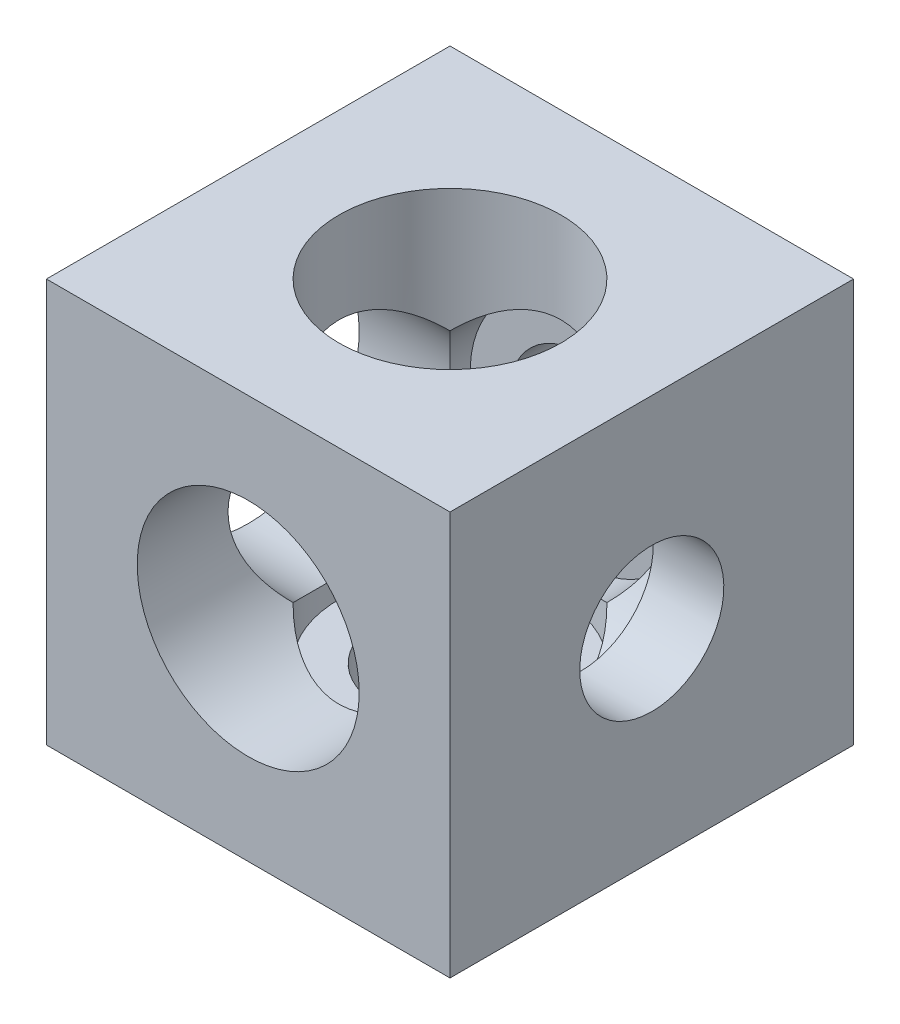
ISO-10303-21;
HEADER;
FILE_DESCRIPTION(('STEP AP214'),'2;1');
FILE_NAME('part.step','',(''),(''),'','','');
FILE_SCHEMA(('AUTOMOTIVE_DESIGN { 1 0 10303 214 1 1 1 1 }'));
ENDSEC;
DATA;
#1=APPLICATION_CONTEXT('core data for automotive mechanical design processes');
#2=APPLICATION_PROTOCOL_DEFINITION('international standard','automotive_design',2000,#1);
#3=PRODUCT_CONTEXT('',#1,'mechanical');
#4=PRODUCT('Part','Part','',(#3));
#5=PRODUCT_RELATED_PRODUCT_CATEGORY('part','',(#4));
#6=PRODUCT_DEFINITION_FORMATION('','',#4);
#7=PRODUCT_DEFINITION_CONTEXT('part definition',#1,'design');
#8=PRODUCT_DEFINITION('design','',#6,#7);
#9=PRODUCT_DEFINITION_SHAPE('','',#8);
#10=(LENGTH_UNIT() NAMED_UNIT(*) SI_UNIT(.MILLI.,.METRE.));
#11=(NAMED_UNIT(*) PLANE_ANGLE_UNIT() SI_UNIT($,.RADIAN.));
#12=(NAMED_UNIT(*) SI_UNIT($,.STERADIAN.) SOLID_ANGLE_UNIT());
#13=UNCERTAINTY_MEASURE_WITH_UNIT(LENGTH_MEASURE(1.E-05),#10,'distance_accuracy_value','');
#14=(GEOMETRIC_REPRESENTATION_CONTEXT(3) GLOBAL_UNCERTAINTY_ASSIGNED_CONTEXT((#13)) GLOBAL_UNIT_ASSIGNED_CONTEXT((#10,
#11,#12)) REPRESENTATION_CONTEXT('',''));
#15=CARTESIAN_POINT('',(0.,0.,0.));
#16=DIRECTION('',(0.,0.,1.));
#17=DIRECTION('',(1.,0.,0.));
#18=AXIS2_PLACEMENT_3D('',#15,#16,#17);
#19=CARTESIAN_POINT('',(0.,-10.,0.));
#20=DIRECTION('',(0.,1.,0.));
#21=DIRECTION('',(0.,0.,1.));
#22=AXIS2_PLACEMENT_3D('',#19,#20,#21);
#23=CYLINDRICAL_SURFACE('',#22,3.57);
#24=CARTESIAN_POINT('',(0.,-10.,0.));
#25=DIRECTION('',(0.,1.,0.));
#26=DIRECTION('',(0.,0.,1.));
#27=AXIS2_PLACEMENT_3D('',#24,#25,#26);
#28=CIRCLE('',#27,3.57);
#29=CARTESIAN_POINT('',(0.,-10.,3.57));
#30=VERTEX_POINT('',#29);
#31=EDGE_CURVE('E144',#30,#30,#28,.T.);
#32=ORIENTED_EDGE('',*,*,#31,.F.);
#33=EDGE_LOOP('',(#32));
#34=FACE_BOUND('',#33,.T.);
#35=CARTESIAN_POINT('',(0.,-6.5,0.));
#36=DIRECTION('',(0.,1.,0.));
#37=DIRECTION('',(0.,0.,1.));
#38=AXIS2_PLACEMENT_3D('',#35,#36,#37);
#39=CIRCLE('',#38,3.57);
#40=CARTESIAN_POINT('',(0.,-6.5,3.57));
#41=VERTEX_POINT('',#40);
#42=EDGE_CURVE('E112',#41,#41,#39,.F.);
#43=ORIENTED_EDGE('',*,*,#42,.F.);
#44=EDGE_LOOP('',(#43));
#45=FACE_BOUND('',#44,.T.);
#46=ADVANCED_FACE('F34',(#34,#45),#23,.F.);
#47=CARTESIAN_POINT('',(0.,0.,-25.556349186104));
#48=DIRECTION('',(0.,0.,1.));
#49=DIRECTION('',(1.,0.,0.));
#50=AXIS2_PLACEMENT_3D('',#47,#48,#49);
#51=CYLINDRICAL_SURFACE('',#50,5.5);
#52=CARTESIAN_POINT('',(0.,0.,10.));
#53=DIRECTION('',(0.,0.,1.));
#54=DIRECTION('',(1.,0.,0.));
#55=AXIS2_PLACEMENT_3D('',#52,#53,#54);
#56=CIRCLE('',#55,5.5);
#57=CARTESIAN_POINT('',(5.5,0.,10.));
#58=VERTEX_POINT('',#57);
#59=EDGE_CURVE('E157',#58,#58,#56,.T.);
#60=ORIENTED_EDGE('',*,*,#59,.T.);
#61=EDGE_LOOP('',(#60));
#62=FACE_BOUND('',#61,.T.);
#63=CARTESIAN_POINT('',(0.,0.,0.));
#64=DIRECTION('',(-0.707106781186547,0.,0.707106781186547));
#65=DIRECTION('',(0.707106781186547,0.,0.707106781186547));
#66=AXIS2_PLACEMENT_3D('',#63,#64,#65);
#67=ELLIPSE('',#66,7.77817459305202,5.5);
#68=CARTESIAN_POINT('',(3.88908729652601,3.88908729652601,3.88908729652601));
#69=VERTEX_POINT('',#68);
#70=CARTESIAN_POINT('',(3.88908729652601,-3.88908729652601,3.88908729652601));
#71=VERTEX_POINT('',#70);
#72=EDGE_CURVE('E103',#69,#71,#67,.F.);
#73=ORIENTED_EDGE('',*,*,#72,.T.);
#74=CARTESIAN_POINT('',(0.,0.,0.));
#75=DIRECTION('',(0.,0.707106781186547,0.707106781186547));
#76=DIRECTION('',(0.,-0.707106781186547,0.707106781186547));
#77=AXIS2_PLACEMENT_3D('',#74,#75,#76);
#78=ELLIPSE('',#77,7.77817459305202,5.5);
#79=CARTESIAN_POINT('',(-3.88908729652601,-3.88908729652601,3.88908729652601));
#80=VERTEX_POINT('',#79);
#81=EDGE_CURVE('E138',#71,#80,#78,.F.);
#82=ORIENTED_EDGE('',*,*,#81,.T.);
#83=CARTESIAN_POINT('',(0.,0.,0.));
#84=DIRECTION('',(0.707106781186547,0.,0.707106781186547));
#85=DIRECTION('',(-0.707106781186547,0.,0.707106781186547));
#86=AXIS2_PLACEMENT_3D('',#83,#84,#85);
#87=ELLIPSE('',#86,7.77817459305202,5.5);
#88=CARTESIAN_POINT('',(-3.88908729652601,3.88908729652601,3.88908729652601));
#89=VERTEX_POINT('',#88);
#90=EDGE_CURVE('E118',#80,#89,#87,.F.);
#91=ORIENTED_EDGE('',*,*,#90,.T.);
#92=CARTESIAN_POINT('',(0.,0.,0.));
#93=DIRECTION('',(0.,-0.707106781186547,0.707106781186547));
#94=DIRECTION('',(0.,0.707106781186547,0.707106781186547));
#95=AXIS2_PLACEMENT_3D('',#92,#93,#94);
#96=ELLIPSE('',#95,7.77817459305202,5.5);
#97=EDGE_CURVE('E56',#89,#69,#96,.F.);
#98=ORIENTED_EDGE('',*,*,#97,.T.);
#99=EDGE_LOOP('',(#73,#82,#91,#98));
#100=FACE_BOUND('',#99,.T.);
#101=ADVANCED_FACE('F201',(#62,#100),#51,.F.);
#102=CARTESIAN_POINT('',(10.,0.,0.));
#103=DIRECTION('',(-1.,0.,0.));
#104=DIRECTION('',(0.,-1.,0.));
#105=AXIS2_PLACEMENT_3D('',#102,#103,#104);
#106=CYLINDRICAL_SURFACE('',#105,3.57);
#107=CARTESIAN_POINT('',(10.,0.,0.));
#108=DIRECTION('',(-1.,0.,0.));
#109=DIRECTION('',(0.,-1.,0.));
#110=AXIS2_PLACEMENT_3D('',#107,#108,#109);
#111=CIRCLE('',#110,3.57);
#112=CARTESIAN_POINT('',(10.,-3.57,0.));
#113=VERTEX_POINT('',#112);
#114=EDGE_CURVE('E154',#113,#113,#111,.T.);
#115=ORIENTED_EDGE('',*,*,#114,.F.);
#116=EDGE_LOOP('',(#115));
#117=FACE_BOUND('',#116,.T.);
#118=CARTESIAN_POINT('',(6.5,0.,0.));
#119=DIRECTION('',(-1.,0.,0.));
#120=DIRECTION('',(0.,-1.,0.));
#121=AXIS2_PLACEMENT_3D('',#118,#119,#120);
#122=CIRCLE('',#121,3.57);
#123=CARTESIAN_POINT('',(6.5,-3.57,0.));
#124=VERTEX_POINT('',#123);
#125=EDGE_CURVE('E153',#124,#124,#122,.F.);
#126=ORIENTED_EDGE('',*,*,#125,.F.);
#127=EDGE_LOOP('',(#126));
#128=FACE_BOUND('',#127,.T.);
#129=ADVANCED_FACE('F225',(#117,#128),#106,.F.);
#130=CARTESIAN_POINT('',(0.,0.,-10.));
#131=DIRECTION('',(0.,0.,1.));
#132=DIRECTION('',(1.,0.,0.));
#133=AXIS2_PLACEMENT_3D('',#130,#131,#132);
#134=CYLINDRICAL_SURFACE('',#133,3.57);
#135=CARTESIAN_POINT('',(0.,0.,-10.));
#136=DIRECTION('',(0.,0.,1.));
#137=DIRECTION('',(1.,0.,0.));
#138=AXIS2_PLACEMENT_3D('',#135,#136,#137);
#139=CIRCLE('',#138,3.57);
#140=CARTESIAN_POINT('',(3.57,0.,-10.));
#141=VERTEX_POINT('',#140);
#142=EDGE_CURVE('E164',#141,#141,#139,.T.);
#143=ORIENTED_EDGE('',*,*,#142,.F.);
#144=EDGE_LOOP('',(#143));
#145=FACE_BOUND('',#144,.T.);
#146=CARTESIAN_POINT('',(0.,0.,-6.5));
#147=DIRECTION('',(0.,0.,1.));
#148=DIRECTION('',(1.,0.,0.));
#149=AXIS2_PLACEMENT_3D('',#146,#147,#148);
#150=CIRCLE('',#149,3.57);
#151=CARTESIAN_POINT('',(3.57,0.,-6.5));
#152=VERTEX_POINT('',#151);
#153=EDGE_CURVE('E163',#152,#152,#150,.F.);
#154=ORIENTED_EDGE('',*,*,#153,.F.);
#155=EDGE_LOOP('',(#154));
#156=FACE_BOUND('',#155,.T.);
#157=ADVANCED_FACE('F289',(#145,#156),#134,.F.);
#158=CARTESIAN_POINT('',(10.,10.,10.));
#159=DIRECTION('',(-1.,0.,0.));
#160=DIRECTION('',(0.,-1.,0.));
#161=AXIS2_PLACEMENT_3D('',#158,#159,#160);
#162=PLANE('',#161);
#163=ORIENTED_EDGE('',*,*,#114,.T.);
#164=EDGE_LOOP('',(#163));
#165=FACE_BOUND('',#164,.T.);
#166=DIRECTION('',(0.,1.,0.));
#167=VECTOR('',#166,1.);
#168=CARTESIAN_POINT('',(10.,10.,-10.));
#169=LINE('',#168,#167);
#170=CARTESIAN_POINT('',(10.,-10.,-10.));
#171=VERTEX_POINT('',#170);
#172=CARTESIAN_POINT('',(10.,10.,-10.));
#173=VERTEX_POINT('',#172);
#174=EDGE_CURVE('E167',#171,#173,#169,.T.);
#175=ORIENTED_EDGE('',*,*,#174,.T.);
#176=DIRECTION('',(0.,0.,-1.));
#177=VECTOR('',#176,1.);
#178=CARTESIAN_POINT('',(10.,10.,10.));
#179=LINE('',#178,#177);
#180=CARTESIAN_POINT('',(10.,10.,10.));
#181=VERTEX_POINT('',#180);
#182=EDGE_CURVE('E194',#181,#173,#179,.T.);
#183=ORIENTED_EDGE('',*,*,#182,.F.);
#184=DIRECTION('',(0.,1.,0.));
#185=VECTOR('',#184,1.);
#186=CARTESIAN_POINT('',(10.,10.,10.));
#187=LINE('',#186,#185);
#188=CARTESIAN_POINT('',(10.,-10.,10.));
#189=VERTEX_POINT('',#188);
#190=EDGE_CURVE('E168',#189,#181,#187,.T.);
#191=ORIENTED_EDGE('',*,*,#190,.F.);
#192=DIRECTION('',(0.,0.,-1.));
#193=VECTOR('',#192,1.);
#194=CARTESIAN_POINT('',(10.,-10.,10.));
#195=LINE('',#194,#193);
#196=EDGE_CURVE('E178',#189,#171,#195,.T.);
#197=ORIENTED_EDGE('',*,*,#196,.T.);
#198=EDGE_LOOP('',(#175,#183,#191,#197));
#199=FACE_BOUND('',#198,.T.);
#200=ADVANCED_FACE('F36',(#165,#199),#162,.F.);
#201=CARTESIAN_POINT('',(-10.,10.,10.));
#202=DIRECTION('',(0.,-1.,0.));
#203=DIRECTION('',(0.,0.,-1.));
#204=AXIS2_PLACEMENT_3D('',#201,#202,#203);
#205=PLANE('',#204);
#206=CARTESIAN_POINT('',(0.,10.,0.));
#207=DIRECTION('',(0.,1.,0.));
#208=DIRECTION('',(0.,0.,1.));
#209=AXIS2_PLACEMENT_3D('',#206,#207,#208);
#210=CIRCLE('',#209,5.5);
#211=CARTESIAN_POINT('',(0.,10.,5.5));
#212=VERTEX_POINT('',#211);
#213=EDGE_CURVE('E127',#212,#212,#210,.T.);
#214=ORIENTED_EDGE('',*,*,#213,.F.);
#215=EDGE_LOOP('',(#214));
#216=FACE_BOUND('',#215,.T.);
#217=DIRECTION('',(-1.,0.,0.));
#218=VECTOR('',#217,1.);
#219=CARTESIAN_POINT('',(-10.,10.,-10.));
#220=LINE('',#219,#218);
#221=CARTESIAN_POINT('',(-10.,10.,-10.));
#222=VERTEX_POINT('',#221);
#223=EDGE_CURVE('E181',#173,#222,#220,.T.);
#224=ORIENTED_EDGE('',*,*,#223,.T.);
#225=DIRECTION('',(0.,0.,-1.));
#226=VECTOR('',#225,1.);
#227=CARTESIAN_POINT('',(-10.,10.,10.));
#228=LINE('',#227,#226);
#229=CARTESIAN_POINT('',(-10.,10.,10.));
#230=VERTEX_POINT('',#229);
#231=EDGE_CURVE('E191',#230,#222,#228,.T.);
#232=ORIENTED_EDGE('',*,*,#231,.F.);
#233=DIRECTION('',(-1.,0.,0.));
#234=VECTOR('',#233,1.);
#235=CARTESIAN_POINT('',(-10.,10.,10.));
#236=LINE('',#235,#234);
#237=EDGE_CURVE('E171',#181,#230,#236,.T.);
#238=ORIENTED_EDGE('',*,*,#237,.F.);
#239=ORIENTED_EDGE('',*,*,#182,.T.);
#240=EDGE_LOOP('',(#224,#232,#238,#239));
#241=FACE_BOUND('',#240,.T.);
#242=ADVANCED_FACE('F346',(#216,#241),#205,.F.);
#243=CARTESIAN_POINT('',(-10.,10.,10.));
#244=DIRECTION('',(1.,0.,0.));
#245=DIRECTION('',(0.,1.,0.));
#246=AXIS2_PLACEMENT_3D('',#243,#244,#245);
#247=PLANE('',#246);
#248=CARTESIAN_POINT('',(-10.,0.,0.));
#249=DIRECTION('',(-1.,0.,0.));
#250=DIRECTION('',(0.,-1.,0.));
#251=AXIS2_PLACEMENT_3D('',#248,#249,#250);
#252=CIRCLE('',#251,5.5);
#253=CARTESIAN_POINT('',(-10.,-5.5,0.));
#254=VERTEX_POINT('',#253);
#255=EDGE_CURVE('E147',#254,#254,#252,.T.);
#256=ORIENTED_EDGE('',*,*,#255,.F.);
#257=EDGE_LOOP('',(#256));
#258=FACE_BOUND('',#257,.T.);
#259=DIRECTION('',(0.,-1.,0.));
#260=VECTOR('',#259,1.);
#261=CARTESIAN_POINT('',(-10.,10.,-10.));
#262=LINE('',#261,#260);
#263=CARTESIAN_POINT('',(-10.,-10.,-10.));
#264=VERTEX_POINT('',#263);
#265=EDGE_CURVE('E183',#222,#264,#262,.T.);
#266=ORIENTED_EDGE('',*,*,#265,.T.);
#267=DIRECTION('',(0.,0.,-1.));
#268=VECTOR('',#267,1.);
#269=CARTESIAN_POINT('',(-10.,-10.,10.));
#270=LINE('',#269,#268);
#271=CARTESIAN_POINT('',(-10.,-10.,10.));
#272=VERTEX_POINT('',#271);
#273=EDGE_CURVE('E188',#272,#264,#270,.T.);
#274=ORIENTED_EDGE('',*,*,#273,.F.);
#275=DIRECTION('',(0.,-1.,0.));
#276=VECTOR('',#275,1.);
#277=CARTESIAN_POINT('',(-10.,10.,10.));
#278=LINE('',#277,#276);
#279=EDGE_CURVE('E174',#230,#272,#278,.T.);
#280=ORIENTED_EDGE('',*,*,#279,.F.);
#281=ORIENTED_EDGE('',*,*,#231,.T.);
#282=EDGE_LOOP('',(#266,#274,#280,#281));
#283=FACE_BOUND('',#282,.T.);
#284=ADVANCED_FACE('F338',(#258,#283),#247,.F.);
#285=CARTESIAN_POINT('',(-10.,-10.,10.));
#286=DIRECTION('',(0.,1.,0.));
#287=DIRECTION('',(0.,0.,1.));
#288=AXIS2_PLACEMENT_3D('',#285,#286,#287);
#289=PLANE('',#288);
#290=ORIENTED_EDGE('',*,*,#31,.T.);
#291=EDGE_LOOP('',(#290));
#292=FACE_BOUND('',#291,.T.);
#293=DIRECTION('',(1.,0.,0.));
#294=VECTOR('',#293,1.);
#295=CARTESIAN_POINT('',(-10.,-10.,-10.));
#296=LINE('',#295,#294);
#297=EDGE_CURVE('E172',#264,#171,#296,.T.);
#298=ORIENTED_EDGE('',*,*,#297,.T.);
#299=ORIENTED_EDGE('',*,*,#196,.F.);
#300=DIRECTION('',(1.,0.,0.));
#301=VECTOR('',#300,1.);
#302=CARTESIAN_POINT('',(-10.,-10.,10.));
#303=LINE('',#302,#301);
#304=EDGE_CURVE('E176',#272,#189,#303,.T.);
#305=ORIENTED_EDGE('',*,*,#304,.F.);
#306=ORIENTED_EDGE('',*,*,#273,.T.);
#307=EDGE_LOOP('',(#298,#299,#305,#306));
#308=FACE_BOUND('',#307,.T.);
#309=ADVANCED_FACE('F330',(#292,#308),#289,.F.);
#310=CARTESIAN_POINT('',(0.,0.,10.));
#311=DIRECTION('',(0.,0.,1.));
#312=DIRECTION('',(1.,0.,0.));
#313=AXIS2_PLACEMENT_3D('',#310,#311,#312);
#314=PLANE('',#313);
#315=ORIENTED_EDGE('',*,*,#59,.F.);
#316=EDGE_LOOP('',(#315));
#317=FACE_BOUND('',#316,.T.);
#318=ORIENTED_EDGE('',*,*,#190,.T.);
#319=ORIENTED_EDGE('',*,*,#237,.T.);
#320=ORIENTED_EDGE('',*,*,#279,.T.);
#321=ORIENTED_EDGE('',*,*,#304,.T.);
#322=EDGE_LOOP('',(#318,#319,#320,#321));
#323=FACE_BOUND('',#322,.T.);
#324=ADVANCED_FACE('F322',(#317,#323),#314,.T.);
#325=CARTESIAN_POINT('',(0.,0.,-10.));
#326=DIRECTION('',(0.,0.,1.));
#327=DIRECTION('',(1.,0.,0.));
#328=AXIS2_PLACEMENT_3D('',#325,#326,#327);
#329=PLANE('',#328);
#330=ORIENTED_EDGE('',*,*,#142,.T.);
#331=EDGE_LOOP('',(#330));
#332=FACE_BOUND('',#331,.T.);
#333=ORIENTED_EDGE('',*,*,#174,.F.);
#334=ORIENTED_EDGE('',*,*,#297,.F.);
#335=ORIENTED_EDGE('',*,*,#265,.F.);
#336=ORIENTED_EDGE('',*,*,#223,.F.);
#337=EDGE_LOOP('',(#333,#334,#335,#336));
#338=FACE_BOUND('',#337,.T.);
#339=ADVANCED_FACE('F304',(#332,#338),#329,.F.);
#340=CARTESIAN_POINT('',(0.,0.,-6.5));
#341=DIRECTION('',(0.,0.,1.));
#342=DIRECTION('',(1.,0.,0.));
#343=AXIS2_PLACEMENT_3D('',#340,#341,#342);
#344=PLANE('',#343);
#345=CARTESIAN_POINT('',(0.,0.,-6.5));
#346=DIRECTION('',(0.,0.,1.));
#347=DIRECTION('',(1.,0.,0.));
#348=AXIS2_PLACEMENT_3D('',#345,#346,#347);
#349=CIRCLE('',#348,5.5);
#350=CARTESIAN_POINT('',(5.5,0.,-6.5));
#351=VERTEX_POINT('',#350);
#352=EDGE_CURVE('E160',#351,#351,#349,.F.);
#353=ORIENTED_EDGE('',*,*,#352,.F.);
#354=EDGE_LOOP('',(#353));
#355=FACE_BOUND('',#354,.T.);
#356=ORIENTED_EDGE('',*,*,#153,.T.);
#357=EDGE_LOOP('',(#356));
#358=FACE_BOUND('',#357,.T.);
#359=ADVANCED_FACE('F297',(#355,#358),#344,.T.);
#360=CARTESIAN_POINT('',(0.,0.,0.));
#361=DIRECTION('',(0.707106781186547,0.,0.707106781186547));
#362=DIRECTION('',(-0.707106781186547,0.,0.707106781186547));
#363=AXIS2_PLACEMENT_3D('',#360,#361,#362);
#364=ELLIPSE('',#363,7.77817459305202,5.5);
#365=CARTESIAN_POINT('',(3.88908729652601,-3.88908729652601,-3.88908729652601));
#366=VERTEX_POINT('',#365);
#367=CARTESIAN_POINT('',(3.88908729652601,3.88908729652601,-3.88908729652601));
#368=VERTEX_POINT('',#367);
#369=EDGE_CURVE('E111',#366,#368,#364,.T.);
#370=ORIENTED_EDGE('',*,*,#369,.T.);
#371=CARTESIAN_POINT('',(0.,0.,0.));
#372=DIRECTION('',(0.,0.707106781186547,0.707106781186547));
#373=DIRECTION('',(0.,-0.707106781186547,0.707106781186547));
#374=AXIS2_PLACEMENT_3D('',#371,#372,#373);
#375=ELLIPSE('',#374,7.77817459305202,5.5);
#376=CARTESIAN_POINT('',(-3.88908729652601,3.88908729652601,-3.88908729652601));
#377=VERTEX_POINT('',#376);
#378=EDGE_CURVE('E97',#368,#377,#375,.T.);
#379=ORIENTED_EDGE('',*,*,#378,.T.);
#380=CARTESIAN_POINT('',(0.,0.,0.));
#381=DIRECTION('',(-0.707106781186547,0.,0.707106781186547));
#382=DIRECTION('',(0.707106781186547,0.,0.707106781186547));
#383=AXIS2_PLACEMENT_3D('',#380,#381,#382);
#384=ELLIPSE('',#383,7.77817459305202,5.5);
#385=CARTESIAN_POINT('',(-3.88908729652601,-3.88908729652601,-3.88908729652601));
#386=VERTEX_POINT('',#385);
#387=EDGE_CURVE('E109',#377,#386,#384,.T.);
#388=ORIENTED_EDGE('',*,*,#387,.T.);
#389=CARTESIAN_POINT('',(0.,0.,0.));
#390=DIRECTION('',(0.,-0.707106781186547,0.707106781186547));
#391=DIRECTION('',(0.,0.707106781186547,0.707106781186547));
#392=AXIS2_PLACEMENT_3D('',#389,#390,#391);
#393=ELLIPSE('',#392,7.77817459305202,5.5);
#394=EDGE_CURVE('E49',#386,#366,#393,.T.);
#395=ORIENTED_EDGE('',*,*,#394,.T.);
#396=EDGE_LOOP('',(#370,#379,#388,#395));
#397=FACE_BOUND('',#396,.T.);
#398=ORIENTED_EDGE('',*,*,#352,.T.);
#399=EDGE_LOOP('',(#398));
#400=FACE_BOUND('',#399,.T.);
#401=ADVANCED_FACE('F107',(#397,#400),#51,.F.);
#402=CARTESIAN_POINT('',(6.5,10.,10.));
#403=DIRECTION('',(-1.,0.,0.));
#404=DIRECTION('',(0.,-1.,0.));
#405=AXIS2_PLACEMENT_3D('',#402,#403,#404);
#406=PLANE('',#405);
#407=CARTESIAN_POINT('',(6.5,0.,0.));
#408=DIRECTION('',(-1.,0.,0.));
#409=DIRECTION('',(0.,-1.,0.));
#410=AXIS2_PLACEMENT_3D('',#407,#408,#409);
#411=CIRCLE('',#410,5.5);
#412=CARTESIAN_POINT('',(6.5,-5.5,0.));
#413=VERTEX_POINT('',#412);
#414=EDGE_CURVE('E150',#413,#413,#411,.F.);
#415=ORIENTED_EDGE('',*,*,#414,.F.);
#416=EDGE_LOOP('',(#415));
#417=FACE_BOUND('',#416,.T.);
#418=ORIENTED_EDGE('',*,*,#125,.T.);
#419=EDGE_LOOP('',(#418));
#420=FACE_BOUND('',#419,.T.);
#421=ADVANCED_FACE('F207',(#417,#420),#406,.T.);
#422=CARTESIAN_POINT('',(25.5563491861041,0.,0.));
#423=DIRECTION('',(-1.,0.,0.));
#424=DIRECTION('',(0.,-1.,0.));
#425=AXIS2_PLACEMENT_3D('',#422,#423,#424);
#426=CYLINDRICAL_SURFACE('',#425,5.5);
#427=ORIENTED_EDGE('',*,*,#414,.T.);
#428=EDGE_LOOP('',(#427));
#429=FACE_BOUND('',#428,.T.);
#430=ORIENTED_EDGE('',*,*,#72,.F.);
#431=CARTESIAN_POINT('',(0.,0.,0.));
#432=DIRECTION('',(-0.707106781186548,0.707106781186547,0.));
#433=DIRECTION('',(-0.707106781186547,-0.707106781186548,0.));
#434=AXIS2_PLACEMENT_3D('',#431,#432,#433);
#435=ELLIPSE('',#434,7.77817459305202,5.5);
#436=EDGE_CURVE('E135',#69,#368,#435,.T.);
#437=ORIENTED_EDGE('',*,*,#436,.T.);
#438=ORIENTED_EDGE('',*,*,#369,.F.);
#439=CARTESIAN_POINT('',(0.,0.,0.));
#440=DIRECTION('',(-0.707106781186547,-0.707106781186548,0.));
#441=DIRECTION('',(-0.707106781186548,0.707106781186547,0.));
#442=AXIS2_PLACEMENT_3D('',#439,#440,#441);
#443=ELLIPSE('',#442,7.77817459305202,5.5);
#444=EDGE_CURVE('E141',#366,#71,#443,.T.);
#445=ORIENTED_EDGE('',*,*,#444,.T.);
#446=EDGE_LOOP('',(#430,#437,#438,#445));
#447=FACE_BOUND('',#446,.T.);
#448=ADVANCED_FACE('F205',(#429,#447),#426,.F.);
#449=ORIENTED_EDGE('',*,*,#255,.T.);
#450=EDGE_LOOP('',(#449));
#451=FACE_BOUND('',#450,.T.);
#452=ORIENTED_EDGE('',*,*,#90,.F.);
#453=CARTESIAN_POINT('',(0.,0.,0.));
#454=DIRECTION('',(-0.707106781186548,0.707106781186547,0.));
#455=DIRECTION('',(-0.707106781186547,-0.707106781186548,0.));
#456=AXIS2_PLACEMENT_3D('',#453,#454,#455);
#457=ELLIPSE('',#456,7.77817459305202,5.5);
#458=EDGE_CURVE('E12',#80,#386,#457,.F.);
#459=ORIENTED_EDGE('',*,*,#458,.T.);
#460=ORIENTED_EDGE('',*,*,#387,.F.);
#461=CARTESIAN_POINT('',(0.,0.,0.));
#462=DIRECTION('',(-0.707106781186547,-0.707106781186548,0.));
#463=DIRECTION('',(-0.707106781186548,0.707106781186547,0.));
#464=AXIS2_PLACEMENT_3D('',#461,#462,#463);
#465=ELLIPSE('',#464,7.77817459305202,5.5);
#466=EDGE_CURVE('E42',#377,#89,#465,.F.);
#467=ORIENTED_EDGE('',*,*,#466,.T.);
#468=EDGE_LOOP('',(#452,#459,#460,#467));
#469=FACE_BOUND('',#468,.T.);
#470=ADVANCED_FACE('F114',(#451,#469),#426,.F.);
#471=CARTESIAN_POINT('',(-10.,-6.5,10.));
#472=DIRECTION('',(0.,1.,0.));
#473=DIRECTION('',(0.,0.,1.));
#474=AXIS2_PLACEMENT_3D('',#471,#472,#473);
#475=PLANE('',#474);
#476=CARTESIAN_POINT('',(0.,-6.5,0.));
#477=DIRECTION('',(0.,1.,0.));
#478=DIRECTION('',(0.,0.,1.));
#479=AXIS2_PLACEMENT_3D('',#476,#477,#478);
#480=CIRCLE('',#479,5.5);
#481=CARTESIAN_POINT('',(0.,-6.5,5.5));
#482=VERTEX_POINT('',#481);
#483=EDGE_CURVE('E123',#482,#482,#480,.F.);
#484=ORIENTED_EDGE('',*,*,#483,.F.);
#485=EDGE_LOOP('',(#484));
#486=FACE_BOUND('',#485,.T.);
#487=ORIENTED_EDGE('',*,*,#42,.T.);
#488=EDGE_LOOP('',(#487));
#489=FACE_BOUND('',#488,.T.);
#490=ADVANCED_FACE('F214',(#486,#489),#475,.T.);
#491=CARTESIAN_POINT('',(0.,-25.556349186104,0.));
#492=DIRECTION('',(0.,1.,0.));
#493=DIRECTION('',(0.,0.,1.));
#494=AXIS2_PLACEMENT_3D('',#491,#492,#493);
#495=CYLINDRICAL_SURFACE('',#494,5.5);
#496=ORIENTED_EDGE('',*,*,#483,.T.);
#497=EDGE_LOOP('',(#496));
#498=FACE_BOUND('',#497,.T.);
#499=ORIENTED_EDGE('',*,*,#394,.F.);
#500=ORIENTED_EDGE('',*,*,#458,.F.);
#501=ORIENTED_EDGE('',*,*,#81,.F.);
#502=ORIENTED_EDGE('',*,*,#444,.F.);
#503=EDGE_LOOP('',(#499,#500,#501,#502));
#504=FACE_BOUND('',#503,.T.);
#505=ADVANCED_FACE('F203',(#498,#504),#495,.F.);
#506=ORIENTED_EDGE('',*,*,#213,.T.);
#507=EDGE_LOOP('',(#506));
#508=FACE_BOUND('',#507,.T.);
#509=ORIENTED_EDGE('',*,*,#97,.F.);
#510=ORIENTED_EDGE('',*,*,#466,.F.);
#511=ORIENTED_EDGE('',*,*,#378,.F.);
#512=ORIENTED_EDGE('',*,*,#436,.F.);
#513=EDGE_LOOP('',(#509,#510,#511,#512));
#514=FACE_BOUND('',#513,.T.);
#515=ADVANCED_FACE('F96',(#508,#514),#495,.F.);
#516=CLOSED_SHELL('',(#46,#101,#129,#157,#200,#242,#284,#309,#324,#339,#359,#401,#421,#448,#470,
#490,#505,#515));
#517=MANIFOLD_SOLID_BREP('B2',#516);
#518=ADVANCED_BREP_SHAPE_REPRESENTATION('',(#18,#517),#14);
#519=SHAPE_DEFINITION_REPRESENTATION(#9,#518);
ENDSEC;
END-ISO-10303-21;
